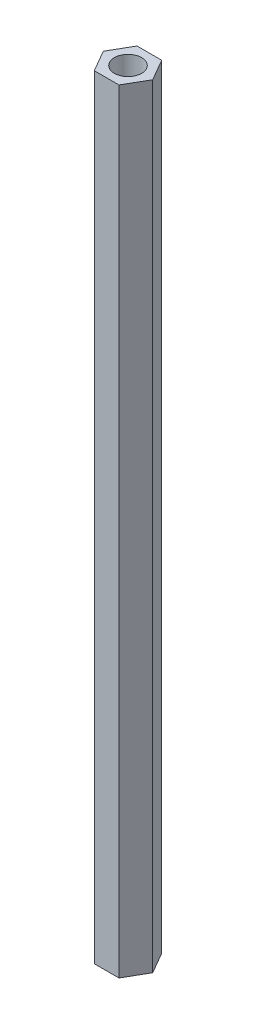
ISO-10303-21;
HEADER;
FILE_DESCRIPTION(('STEP AP214'),'2;1');
FILE_NAME('part.step','',(''),(''),'','','');
FILE_SCHEMA(('AUTOMOTIVE_DESIGN { 1 0 10303 214 1 1 1 1 }'));
ENDSEC;
DATA;
#1=APPLICATION_CONTEXT('core data for automotive mechanical design processes');
#2=APPLICATION_PROTOCOL_DEFINITION('international standard','automotive_design',2000,#1);
#3=PRODUCT_CONTEXT('',#1,'mechanical');
#4=PRODUCT('Part','Part','',(#3));
#5=PRODUCT_RELATED_PRODUCT_CATEGORY('part','',(#4));
#6=PRODUCT_DEFINITION_FORMATION('','',#4);
#7=PRODUCT_DEFINITION_CONTEXT('part definition',#1,'design');
#8=PRODUCT_DEFINITION('design','',#6,#7);
#9=PRODUCT_DEFINITION_SHAPE('','',#8);
#10=(LENGTH_UNIT() NAMED_UNIT(*) SI_UNIT(.MILLI.,.METRE.));
#11=(NAMED_UNIT(*) PLANE_ANGLE_UNIT() SI_UNIT($,.RADIAN.));
#12=(NAMED_UNIT(*) SI_UNIT($,.STERADIAN.) SOLID_ANGLE_UNIT());
#13=UNCERTAINTY_MEASURE_WITH_UNIT(LENGTH_MEASURE(1.E-05),#10,'distance_accuracy_value','');
#14=(GEOMETRIC_REPRESENTATION_CONTEXT(3) GLOBAL_UNCERTAINTY_ASSIGNED_CONTEXT((#13)) GLOBAL_UNIT_ASSIGNED_CONTEXT((#10,
#11,#12)) REPRESENTATION_CONTEXT('',''));
#15=CARTESIAN_POINT('',(0.,0.,0.));
#16=DIRECTION('',(0.,0.,1.));
#17=DIRECTION('',(1.,0.,0.));
#18=AXIS2_PLACEMENT_3D('',#15,#16,#17);
#19=CARTESIAN_POINT('',(0.,85.,0.));
#20=DIRECTION('',(0.,1.,0.));
#21=DIRECTION('',(0.,0.,1.));
#22=AXIS2_PLACEMENT_3D('',#19,#20,#21);
#23=PLANE('',#22);
#24=DIRECTION('',(0.499999999999985,0.,-0.866025403784447));
#25=VECTOR('',#24,1.);
#26=CARTESIAN_POINT('',(1.35677313259566,85.,2.35000000000002));
#27=LINE('',#26,#25);
#28=CARTESIAN_POINT('',(1.35677313259566,85.,2.35000000000002));
#29=VERTEX_POINT('',#28);
#30=CARTESIAN_POINT('',(2.71354626519124,85.,0.));
#31=VERTEX_POINT('',#30);
#32=EDGE_CURVE('E128',#29,#31,#27,.T.);
#33=ORIENTED_EDGE('',*,*,#32,.T.);
#34=DIRECTION('',(-0.500000000000015,0.,-0.86602540378443));
#35=VECTOR('',#34,1.);
#36=CARTESIAN_POINT('',(2.71354626519124,85.,0.));
#37=LINE('',#36,#35);
#38=CARTESIAN_POINT('',(1.35677313259558,85.,-2.34999999999998));
#39=VERTEX_POINT('',#38);
#40=EDGE_CURVE('E86',#31,#39,#37,.T.);
#41=ORIENTED_EDGE('',*,*,#40,.T.);
#42=DIRECTION('',(-1.,0.,0.));
#43=VECTOR('',#42,1.);
#44=CARTESIAN_POINT('',(1.35677313259558,85.,-2.34999999999998));
#45=LINE('',#44,#43);
#46=CARTESIAN_POINT('',(-1.35677313259566,85.,-2.34999999999994));
#47=VERTEX_POINT('',#46);
#48=EDGE_CURVE('E99',#39,#47,#45,.T.);
#49=ORIENTED_EDGE('',*,*,#48,.T.);
#50=DIRECTION('',(-0.499999999999985,0.,0.866025403784447));
#51=VECTOR('',#50,1.);
#52=CARTESIAN_POINT('',(-1.35677313259566,85.,-2.34999999999994));
#53=LINE('',#52,#51);
#54=CARTESIAN_POINT('',(-2.71354626519124,85.,0.));
#55=VERTEX_POINT('',#54);
#56=EDGE_CURVE('E93',#47,#55,#53,.T.);
#57=ORIENTED_EDGE('',*,*,#56,.T.);
#58=DIRECTION('',(0.500000000000015,0.,0.86602540378443));
#59=VECTOR('',#58,1.);
#60=CARTESIAN_POINT('',(-2.71354626519124,85.,0.));
#61=LINE('',#60,#59);
#62=CARTESIAN_POINT('',(-1.35677313259558,85.,2.35000000000006));
#63=VERTEX_POINT('',#62);
#64=EDGE_CURVE('E97',#55,#63,#61,.T.);
#65=ORIENTED_EDGE('',*,*,#64,.T.);
#66=DIRECTION('',(1.,0.,0.));
#67=VECTOR('',#66,1.);
#68=CARTESIAN_POINT('',(-1.35677313259558,85.,2.35000000000006));
#69=LINE('',#68,#67);
#70=EDGE_CURVE('E49',#63,#29,#69,.T.);
#71=ORIENTED_EDGE('',*,*,#70,.T.);
#72=EDGE_LOOP('',(#33,#41,#49,#57,#65,#71));
#73=FACE_BOUND('',#72,.T.);
#74=CARTESIAN_POINT('',(0.,85.,0.));
#75=DIRECTION('',(0.,1.,0.));
#76=DIRECTION('',(0.,0.,1.));
#77=AXIS2_PLACEMENT_3D('',#74,#75,#76);
#78=CIRCLE('',#77,1.5);
#79=CARTESIAN_POINT('',(0.,85.,1.5));
#80=VERTEX_POINT('',#79);
#81=EDGE_CURVE('E121',#80,#80,#78,.T.);
#82=ORIENTED_EDGE('',*,*,#81,.F.);
#83=EDGE_LOOP('',(#82));
#84=FACE_BOUND('',#83,.T.);
#85=ADVANCED_FACE('F32',(#73,#84),#23,.T.);
#86=CARTESIAN_POINT('',(0.,0.,0.));
#87=DIRECTION('',(0.,1.,0.));
#88=DIRECTION('',(0.,0.,1.));
#89=AXIS2_PLACEMENT_3D('',#86,#87,#88);
#90=PLANE('',#89);
#91=DIRECTION('',(0.499999999999985,0.,-0.866025403784447));
#92=VECTOR('',#91,1.);
#93=CARTESIAN_POINT('',(1.35677313259566,0.,2.35000000000002));
#94=LINE('',#93,#92);
#95=CARTESIAN_POINT('',(1.35677313259566,0.,2.35000000000002));
#96=VERTEX_POINT('',#95);
#97=CARTESIAN_POINT('',(2.71354626519124,0.,0.));
#98=VERTEX_POINT('',#97);
#99=EDGE_CURVE('E117',#96,#98,#94,.T.);
#100=ORIENTED_EDGE('',*,*,#99,.F.);
#101=DIRECTION('',(1.,0.,0.));
#102=VECTOR('',#101,1.);
#103=CARTESIAN_POINT('',(-1.35677313259558,0.,2.35000000000006));
#104=LINE('',#103,#102);
#105=CARTESIAN_POINT('',(-1.35677313259558,0.,2.35000000000006));
#106=VERTEX_POINT('',#105);
#107=EDGE_CURVE('E78',#106,#96,#104,.T.);
#108=ORIENTED_EDGE('',*,*,#107,.F.);
#109=DIRECTION('',(0.500000000000015,0.,0.86602540378443));
#110=VECTOR('',#109,1.);
#111=CARTESIAN_POINT('',(-2.71354626519124,0.,0.));
#112=LINE('',#111,#110);
#113=CARTESIAN_POINT('',(-2.71354626519124,0.,0.));
#114=VERTEX_POINT('',#113);
#115=EDGE_CURVE('E72',#114,#106,#112,.T.);
#116=ORIENTED_EDGE('',*,*,#115,.F.);
#117=DIRECTION('',(-0.499999999999985,0.,0.866025403784447));
#118=VECTOR('',#117,1.);
#119=CARTESIAN_POINT('',(-1.35677313259566,0.,-2.34999999999994));
#120=LINE('',#119,#118);
#121=CARTESIAN_POINT('',(-1.35677313259566,0.,-2.34999999999994));
#122=VERTEX_POINT('',#121);
#123=EDGE_CURVE('E107',#122,#114,#120,.T.);
#124=ORIENTED_EDGE('',*,*,#123,.F.);
#125=DIRECTION('',(-1.,0.,0.));
#126=VECTOR('',#125,1.);
#127=CARTESIAN_POINT('',(1.35677313259558,0.,-2.34999999999998));
#128=LINE('',#127,#126);
#129=CARTESIAN_POINT('',(1.35677313259558,0.,-2.34999999999998));
#130=VERTEX_POINT('',#129);
#131=EDGE_CURVE('E123',#130,#122,#128,.T.);
#132=ORIENTED_EDGE('',*,*,#131,.F.);
#133=DIRECTION('',(-0.500000000000015,0.,-0.86602540378443));
#134=VECTOR('',#133,1.);
#135=CARTESIAN_POINT('',(2.71354626519124,0.,0.));
#136=LINE('',#135,#134);
#137=EDGE_CURVE('E120',#98,#130,#136,.T.);
#138=ORIENTED_EDGE('',*,*,#137,.F.);
#139=EDGE_LOOP('',(#100,#108,#116,#124,#132,#138));
#140=FACE_BOUND('',#139,.T.);
#141=CARTESIAN_POINT('',(0.,0.,0.));
#142=DIRECTION('',(0.,1.,0.));
#143=DIRECTION('',(0.,0.,1.));
#144=AXIS2_PLACEMENT_3D('',#141,#142,#143);
#145=CIRCLE('',#144,1.5);
#146=CARTESIAN_POINT('',(0.,0.,1.5));
#147=VERTEX_POINT('',#146);
#148=EDGE_CURVE('E221',#147,#147,#145,.T.);
#149=ORIENTED_EDGE('',*,*,#148,.T.);
#150=EDGE_LOOP('',(#149));
#151=FACE_BOUND('',#150,.T.);
#152=ADVANCED_FACE('F137',(#140,#151),#90,.F.);
#153=CARTESIAN_POINT('',(1.35677313259566,85.,2.35000000000002));
#154=DIRECTION('',(-0.866025403784447,0.,-0.499999999999985));
#155=DIRECTION('',(-0.499999999999985,0.,0.866025403784447));
#156=AXIS2_PLACEMENT_3D('',#153,#154,#155);
#157=PLANE('',#156);
#158=ORIENTED_EDGE('',*,*,#99,.T.);
#159=DIRECTION('',(0.,-1.,0.));
#160=VECTOR('',#159,1.);
#161=CARTESIAN_POINT('',(2.71354626519124,85.,0.));
#162=LINE('',#161,#160);
#163=EDGE_CURVE('E11',#31,#98,#162,.T.);
#164=ORIENTED_EDGE('',*,*,#163,.F.);
#165=ORIENTED_EDGE('',*,*,#32,.F.);
#166=DIRECTION('',(0.,-1.,0.));
#167=VECTOR('',#166,1.);
#168=CARTESIAN_POINT('',(1.35677313259566,85.,2.35000000000002));
#169=LINE('',#168,#167);
#170=EDGE_CURVE('E113',#29,#96,#169,.T.);
#171=ORIENTED_EDGE('',*,*,#170,.T.);
#172=EDGE_LOOP('',(#158,#164,#165,#171));
#173=FACE_BOUND('',#172,.T.);
#174=ADVANCED_FACE('F34',(#173),#157,.F.);
#175=CARTESIAN_POINT('',(2.71354626519124,85.,0.));
#176=DIRECTION('',(-0.86602540378443,0.,0.500000000000015));
#177=DIRECTION('',(0.500000000000015,0.,0.86602540378443));
#178=AXIS2_PLACEMENT_3D('',#175,#176,#177);
#179=PLANE('',#178);
#180=ORIENTED_EDGE('',*,*,#137,.T.);
#181=DIRECTION('',(0.,-1.,0.));
#182=VECTOR('',#181,1.);
#183=CARTESIAN_POINT('',(1.35677313259558,85.,-2.34999999999998));
#184=LINE('',#183,#182);
#185=EDGE_CURVE('E41',#39,#130,#184,.T.);
#186=ORIENTED_EDGE('',*,*,#185,.F.);
#187=ORIENTED_EDGE('',*,*,#40,.F.);
#188=ORIENTED_EDGE('',*,*,#163,.T.);
#189=EDGE_LOOP('',(#180,#186,#187,#188));
#190=FACE_BOUND('',#189,.T.);
#191=ADVANCED_FACE('F162',(#190),#179,.F.);
#192=CARTESIAN_POINT('',(1.35677313259558,85.,-2.34999999999998));
#193=DIRECTION('',(0.,0.,1.));
#194=DIRECTION('',(1.,0.,0.));
#195=AXIS2_PLACEMENT_3D('',#192,#193,#194);
#196=PLANE('',#195);
#197=ORIENTED_EDGE('',*,*,#131,.T.);
#198=DIRECTION('',(0.,-1.,0.));
#199=VECTOR('',#198,1.);
#200=CARTESIAN_POINT('',(-1.35677313259566,85.,-2.34999999999994));
#201=LINE('',#200,#199);
#202=EDGE_CURVE('E108',#47,#122,#201,.T.);
#203=ORIENTED_EDGE('',*,*,#202,.F.);
#204=ORIENTED_EDGE('',*,*,#48,.F.);
#205=ORIENTED_EDGE('',*,*,#185,.T.);
#206=EDGE_LOOP('',(#197,#203,#204,#205));
#207=FACE_BOUND('',#206,.T.);
#208=ADVANCED_FACE('F134',(#207),#196,.F.);
#209=CARTESIAN_POINT('',(-1.35677313259566,85.,-2.34999999999994));
#210=DIRECTION('',(0.866025403784447,0.,0.499999999999985));
#211=DIRECTION('',(0.499999999999985,0.,-0.866025403784447));
#212=AXIS2_PLACEMENT_3D('',#209,#210,#211);
#213=PLANE('',#212);
#214=ORIENTED_EDGE('',*,*,#123,.T.);
#215=DIRECTION('',(0.,-1.,0.));
#216=VECTOR('',#215,1.);
#217=CARTESIAN_POINT('',(-2.71354626519124,85.,0.));
#218=LINE('',#217,#216);
#219=EDGE_CURVE('E104',#55,#114,#218,.T.);
#220=ORIENTED_EDGE('',*,*,#219,.F.);
#221=ORIENTED_EDGE('',*,*,#56,.F.);
#222=ORIENTED_EDGE('',*,*,#202,.T.);
#223=EDGE_LOOP('',(#214,#220,#221,#222));
#224=FACE_BOUND('',#223,.T.);
#225=ADVANCED_FACE('F105',(#224),#213,.F.);
#226=CARTESIAN_POINT('',(-2.71354626519124,85.,0.));
#227=DIRECTION('',(0.86602540378443,0.,-0.500000000000015));
#228=DIRECTION('',(-0.500000000000015,0.,-0.86602540378443));
#229=AXIS2_PLACEMENT_3D('',#226,#227,#228);
#230=PLANE('',#229);
#231=ORIENTED_EDGE('',*,*,#115,.T.);
#232=DIRECTION('',(0.,-1.,0.));
#233=VECTOR('',#232,1.);
#234=CARTESIAN_POINT('',(-1.35677313259558,85.,2.35000000000006));
#235=LINE('',#234,#233);
#236=EDGE_CURVE('E109',#63,#106,#235,.T.);
#237=ORIENTED_EDGE('',*,*,#236,.F.);
#238=ORIENTED_EDGE('',*,*,#64,.F.);
#239=ORIENTED_EDGE('',*,*,#219,.T.);
#240=EDGE_LOOP('',(#231,#237,#238,#239));
#241=FACE_BOUND('',#240,.T.);
#242=ADVANCED_FACE('F111',(#241),#230,.F.);
#243=CARTESIAN_POINT('',(-1.35677313259558,85.,2.35000000000006));
#244=DIRECTION('',(0.,0.,-1.));
#245=DIRECTION('',(-1.,0.,0.));
#246=AXIS2_PLACEMENT_3D('',#243,#244,#245);
#247=PLANE('',#246);
#248=ORIENTED_EDGE('',*,*,#107,.T.);
#249=ORIENTED_EDGE('',*,*,#170,.F.);
#250=ORIENTED_EDGE('',*,*,#70,.F.);
#251=ORIENTED_EDGE('',*,*,#236,.T.);
#252=EDGE_LOOP('',(#248,#249,#250,#251));
#253=FACE_BOUND('',#252,.T.);
#254=ADVANCED_FACE('F142',(#253),#247,.F.);
#255=CARTESIAN_POINT('',(0.,85.,0.));
#256=DIRECTION('',(0.,-1.,0.));
#257=DIRECTION('',(0.,0.,-1.));
#258=AXIS2_PLACEMENT_3D('',#255,#256,#257);
#259=CYLINDRICAL_SURFACE('',#258,1.5);
#260=ORIENTED_EDGE('',*,*,#81,.T.);
#261=EDGE_LOOP('',(#260));
#262=FACE_BOUND('',#261,.T.);
#263=ORIENTED_EDGE('',*,*,#148,.F.);
#264=EDGE_LOOP('',(#263));
#265=FACE_BOUND('',#264,.T.);
#266=ADVANCED_FACE('F144',(#262,#265),#259,.F.);
#267=CLOSED_SHELL('',(#85,#152,#174,#191,#208,#225,#242,#254,#266));
#268=MANIFOLD_SOLID_BREP('B2',#267);
#269=ADVANCED_BREP_SHAPE_REPRESENTATION('',(#18,#268),#14);
#270=SHAPE_DEFINITION_REPRESENTATION(#9,#269);
ENDSEC;
END-ISO-10303-21;
